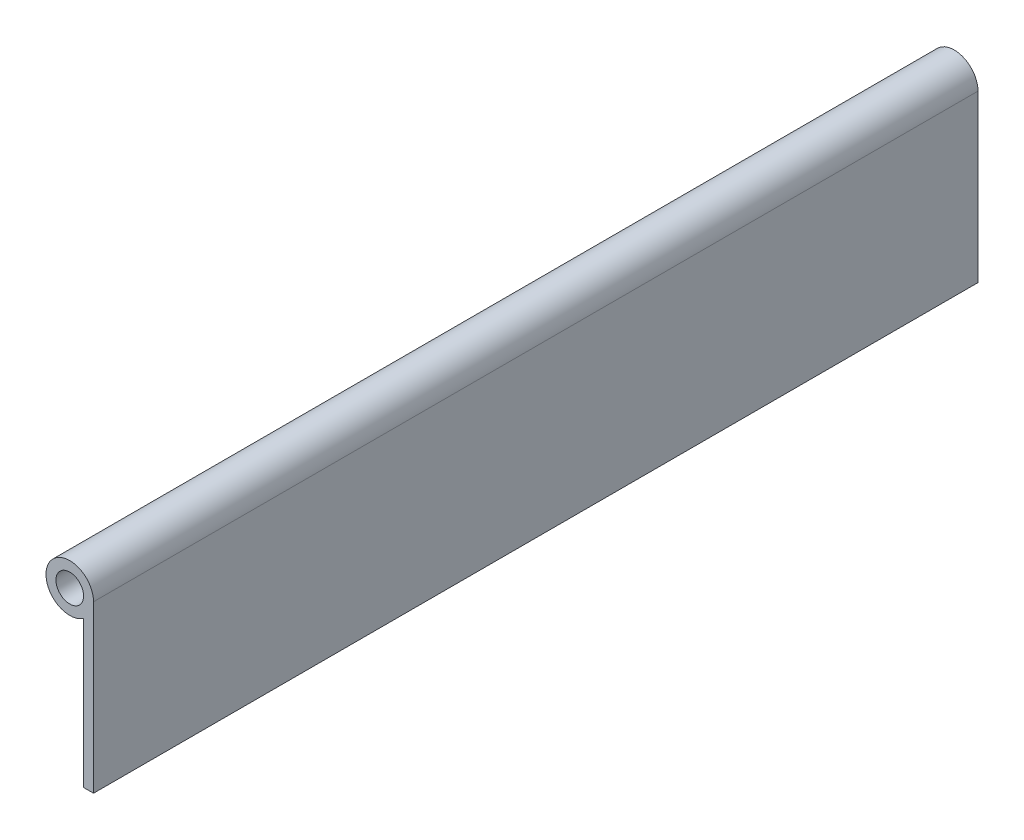
ISO-10303-21;
HEADER;
FILE_DESCRIPTION(('STEP AP214'),'2;1');
FILE_NAME('part.step','',(''),(''),'','','');
FILE_SCHEMA(('AUTOMOTIVE_DESIGN { 1 0 10303 214 1 1 1 1 }'));
ENDSEC;
DATA;
#1=APPLICATION_CONTEXT('core data for automotive mechanical design processes');
#2=APPLICATION_PROTOCOL_DEFINITION('international standard','automotive_design',2000,#1);
#3=PRODUCT_CONTEXT('',#1,'mechanical');
#4=PRODUCT('Part','Part','',(#3));
#5=PRODUCT_RELATED_PRODUCT_CATEGORY('part','',(#4));
#6=PRODUCT_DEFINITION_FORMATION('','',#4);
#7=PRODUCT_DEFINITION_CONTEXT('part definition',#1,'design');
#8=PRODUCT_DEFINITION('design','',#6,#7);
#9=PRODUCT_DEFINITION_SHAPE('','',#8);
#10=(LENGTH_UNIT() NAMED_UNIT(*) SI_UNIT(.MILLI.,.METRE.));
#11=(NAMED_UNIT(*) PLANE_ANGLE_UNIT() SI_UNIT($,.RADIAN.));
#12=(NAMED_UNIT(*) SI_UNIT($,.STERADIAN.) SOLID_ANGLE_UNIT());
#13=UNCERTAINTY_MEASURE_WITH_UNIT(LENGTH_MEASURE(1.E-05),#10,'distance_accuracy_value','');
#14=(GEOMETRIC_REPRESENTATION_CONTEXT(3) GLOBAL_UNCERTAINTY_ASSIGNED_CONTEXT((#13)) GLOBAL_UNIT_ASSIGNED_CONTEXT((#10,
#11,#12)) REPRESENTATION_CONTEXT('',''));
#15=CARTESIAN_POINT('',(0.,0.,0.));
#16=DIRECTION('',(0.,0.,1.));
#17=DIRECTION('',(1.,0.,0.));
#18=AXIS2_PLACEMENT_3D('',#15,#16,#17);
#19=CARTESIAN_POINT('',(0.,0.,203.2));
#20=DIRECTION('',(0.,0.,1.));
#21=DIRECTION('',(1.,0.,0.));
#22=AXIS2_PLACEMENT_3D('',#19,#20,#21);
#23=PLANE('',#22);
#24=CARTESIAN_POINT('',(0.,0.,203.2));
#25=DIRECTION('',(0.,0.,1.));
#26=DIRECTION('',(1.,0.,0.));
#27=AXIS2_PLACEMENT_3D('',#24,#25,#26);
#28=CIRCLE('',#27,5.461);
#29=CARTESIAN_POINT('',(5.461,0.,203.2));
#30=VERTEX_POINT('',#29);
#31=CARTESIAN_POINT('',(3.17500000000001,-4.44318534387211,203.2));
#32=VERTEX_POINT('',#31);
#33=EDGE_CURVE('E89',#30,#32,#28,.T.);
#34=ORIENTED_EDGE('',*,*,#33,.T.);
#35=DIRECTION('',(0.,-1.,0.));
#36=VECTOR('',#35,1.);
#37=CARTESIAN_POINT('',(3.17500000000001,-38.1,203.2));
#38=LINE('',#37,#36);
#39=CARTESIAN_POINT('',(3.17500000000001,-38.1,203.2));
#40=VERTEX_POINT('',#39);
#41=EDGE_CURVE('E84',#32,#40,#38,.T.);
#42=ORIENTED_EDGE('',*,*,#41,.T.);
#43=DIRECTION('',(1.,0.,0.));
#44=VECTOR('',#43,1.);
#45=CARTESIAN_POINT('',(5.461,-38.1,203.2));
#46=LINE('',#45,#44);
#47=CARTESIAN_POINT('',(5.461,-38.1,203.2));
#48=VERTEX_POINT('',#47);
#49=EDGE_CURVE('E87',#40,#48,#46,.T.);
#50=ORIENTED_EDGE('',*,*,#49,.T.);
#51=DIRECTION('',(0.,1.,0.));
#52=VECTOR('',#51,1.);
#53=CARTESIAN_POINT('',(5.461,0.,203.2));
#54=LINE('',#53,#52);
#55=EDGE_CURVE('E54',#48,#30,#54,.T.);
#56=ORIENTED_EDGE('',*,*,#55,.T.);
#57=EDGE_LOOP('',(#34,#42,#50,#56));
#58=FACE_BOUND('',#57,.T.);
#59=CARTESIAN_POINT('',(0.,0.,203.2));
#60=DIRECTION('',(0.,0.,1.));
#61=DIRECTION('',(1.,0.,0.));
#62=AXIS2_PLACEMENT_3D('',#59,#60,#61);
#63=CIRCLE('',#62,3.175);
#64=CARTESIAN_POINT('',(3.175,0.,203.2));
#65=VERTEX_POINT('',#64);
#66=EDGE_CURVE('E104',#65,#65,#63,.T.);
#67=ORIENTED_EDGE('',*,*,#66,.F.);
#68=EDGE_LOOP('',(#67));
#69=FACE_BOUND('',#68,.T.);
#70=ADVANCED_FACE('F37',(#58,#69),#23,.T.);
#71=CARTESIAN_POINT('',(0.,0.,0.));
#72=DIRECTION('',(0.,0.,1.));
#73=DIRECTION('',(1.,0.,0.));
#74=AXIS2_PLACEMENT_3D('',#71,#72,#73);
#75=PLANE('',#74);
#76=CARTESIAN_POINT('',(0.,0.,0.));
#77=DIRECTION('',(0.,0.,1.));
#78=DIRECTION('',(1.,0.,0.));
#79=AXIS2_PLACEMENT_3D('',#76,#77,#78);
#80=CIRCLE('',#79,5.461);
#81=CARTESIAN_POINT('',(5.461,0.,0.));
#82=VERTEX_POINT('',#81);
#83=CARTESIAN_POINT('',(3.17500000000001,-4.44318534387211,0.));
#84=VERTEX_POINT('',#83);
#85=EDGE_CURVE('E101',#82,#84,#80,.T.);
#86=ORIENTED_EDGE('',*,*,#85,.F.);
#87=DIRECTION('',(0.,1.,0.));
#88=VECTOR('',#87,1.);
#89=CARTESIAN_POINT('',(5.461,0.,0.));
#90=LINE('',#89,#88);
#91=CARTESIAN_POINT('',(5.461,-38.1,0.));
#92=VERTEX_POINT('',#91);
#93=EDGE_CURVE('E77',#92,#82,#90,.T.);
#94=ORIENTED_EDGE('',*,*,#93,.F.);
#95=DIRECTION('',(1.,0.,0.));
#96=VECTOR('',#95,1.);
#97=CARTESIAN_POINT('',(5.461,-38.1,0.));
#98=LINE('',#97,#96);
#99=CARTESIAN_POINT('',(3.17500000000001,-38.1,0.));
#100=VERTEX_POINT('',#99);
#101=EDGE_CURVE('E71',#100,#92,#98,.T.);
#102=ORIENTED_EDGE('',*,*,#101,.F.);
#103=DIRECTION('',(0.,-1.,0.));
#104=VECTOR('',#103,1.);
#105=CARTESIAN_POINT('',(3.17500000000001,-38.1,0.));
#106=LINE('',#105,#104);
#107=EDGE_CURVE('E93',#84,#100,#106,.T.);
#108=ORIENTED_EDGE('',*,*,#107,.F.);
#109=EDGE_LOOP('',(#86,#94,#102,#108));
#110=FACE_BOUND('',#109,.T.);
#111=CARTESIAN_POINT('',(0.,0.,0.));
#112=DIRECTION('',(0.,0.,1.));
#113=DIRECTION('',(1.,0.,0.));
#114=AXIS2_PLACEMENT_3D('',#111,#112,#113);
#115=CIRCLE('',#114,3.175);
#116=CARTESIAN_POINT('',(3.175,0.,0.));
#117=VERTEX_POINT('',#116);
#118=EDGE_CURVE('E116',#117,#117,#115,.T.);
#119=ORIENTED_EDGE('',*,*,#118,.T.);
#120=EDGE_LOOP('',(#119));
#121=FACE_BOUND('',#120,.T.);
#122=ADVANCED_FACE('F112',(#110,#121),#75,.F.);
#123=CARTESIAN_POINT('',(0.,0.,203.2));
#124=DIRECTION('',(0.,0.,-1.));
#125=DIRECTION('',(-1.,0.,0.));
#126=AXIS2_PLACEMENT_3D('',#123,#124,#125);
#127=CYLINDRICAL_SURFACE('',#126,5.461);
#128=ORIENTED_EDGE('',*,*,#85,.T.);
#129=DIRECTION('',(0.,0.,-1.));
#130=VECTOR('',#129,1.);
#131=CARTESIAN_POINT('',(3.17500000000001,-4.44318534387211,203.2));
#132=LINE('',#131,#130);
#133=EDGE_CURVE('E11',#32,#84,#132,.T.);
#134=ORIENTED_EDGE('',*,*,#133,.F.);
#135=ORIENTED_EDGE('',*,*,#33,.F.);
#136=DIRECTION('',(0.,0.,-1.));
#137=VECTOR('',#136,1.);
#138=CARTESIAN_POINT('',(5.461,0.,203.2));
#139=LINE('',#138,#137);
#140=EDGE_CURVE('E97',#30,#82,#139,.T.);
#141=ORIENTED_EDGE('',*,*,#140,.T.);
#142=EDGE_LOOP('',(#128,#134,#135,#141));
#143=FACE_BOUND('',#142,.T.);
#144=ADVANCED_FACE('F39',(#143),#127,.T.);
#145=CARTESIAN_POINT('',(3.17500000000001,-38.1,203.2));
#146=DIRECTION('',(1.,0.,0.));
#147=DIRECTION('',(0.,1.,0.));
#148=AXIS2_PLACEMENT_3D('',#145,#146,#147);
#149=PLANE('',#148);
#150=ORIENTED_EDGE('',*,*,#107,.T.);
#151=DIRECTION('',(0.,0.,-1.));
#152=VECTOR('',#151,1.);
#153=CARTESIAN_POINT('',(3.17500000000001,-38.1,203.2));
#154=LINE('',#153,#152);
#155=EDGE_CURVE('E46',#40,#100,#154,.T.);
#156=ORIENTED_EDGE('',*,*,#155,.F.);
#157=ORIENTED_EDGE('',*,*,#41,.F.);
#158=ORIENTED_EDGE('',*,*,#133,.T.);
#159=EDGE_LOOP('',(#150,#156,#157,#158));
#160=FACE_BOUND('',#159,.T.);
#161=ADVANCED_FACE('F92',(#160),#149,.F.);
#162=CARTESIAN_POINT('',(5.461,-38.1,203.2));
#163=DIRECTION('',(0.,1.,0.));
#164=DIRECTION('',(0.,0.,1.));
#165=AXIS2_PLACEMENT_3D('',#162,#163,#164);
#166=PLANE('',#165);
#167=ORIENTED_EDGE('',*,*,#101,.T.);
#168=DIRECTION('',(0.,0.,-1.));
#169=VECTOR('',#168,1.);
#170=CARTESIAN_POINT('',(5.461,-38.1,203.2));
#171=LINE('',#170,#169);
#172=EDGE_CURVE('E94',#48,#92,#171,.T.);
#173=ORIENTED_EDGE('',*,*,#172,.F.);
#174=ORIENTED_EDGE('',*,*,#49,.F.);
#175=ORIENTED_EDGE('',*,*,#155,.T.);
#176=EDGE_LOOP('',(#167,#173,#174,#175));
#177=FACE_BOUND('',#176,.T.);
#178=ADVANCED_FACE('F95',(#177),#166,.F.);
#179=CARTESIAN_POINT('',(5.461,0.,203.2));
#180=DIRECTION('',(-1.,0.,0.));
#181=DIRECTION('',(0.,-1.,0.));
#182=AXIS2_PLACEMENT_3D('',#179,#180,#181);
#183=PLANE('',#182);
#184=ORIENTED_EDGE('',*,*,#93,.T.);
#185=ORIENTED_EDGE('',*,*,#140,.F.);
#186=ORIENTED_EDGE('',*,*,#55,.F.);
#187=ORIENTED_EDGE('',*,*,#172,.T.);
#188=EDGE_LOOP('',(#184,#185,#186,#187));
#189=FACE_BOUND('',#188,.T.);
#190=ADVANCED_FACE('F109',(#189),#183,.F.);
#191=CARTESIAN_POINT('',(0.,0.,203.2));
#192=DIRECTION('',(0.,0.,-1.));
#193=DIRECTION('',(-1.,0.,0.));
#194=AXIS2_PLACEMENT_3D('',#191,#192,#193);
#195=CYLINDRICAL_SURFACE('',#194,3.175);
#196=ORIENTED_EDGE('',*,*,#66,.T.);
#197=EDGE_LOOP('',(#196));
#198=FACE_BOUND('',#197,.T.);
#199=ORIENTED_EDGE('',*,*,#118,.F.);
#200=EDGE_LOOP('',(#199));
#201=FACE_BOUND('',#200,.T.);
#202=ADVANCED_FACE('F122',(#198,#201),#195,.F.);
#203=CLOSED_SHELL('',(#70,#122,#144,#161,#178,#190,#202));
#204=MANIFOLD_SOLID_BREP('B2',#203);
#205=ADVANCED_BREP_SHAPE_REPRESENTATION('',(#18,#204),#14);
#206=SHAPE_DEFINITION_REPRESENTATION(#9,#205);
ENDSEC;
END-ISO-10303-21;
